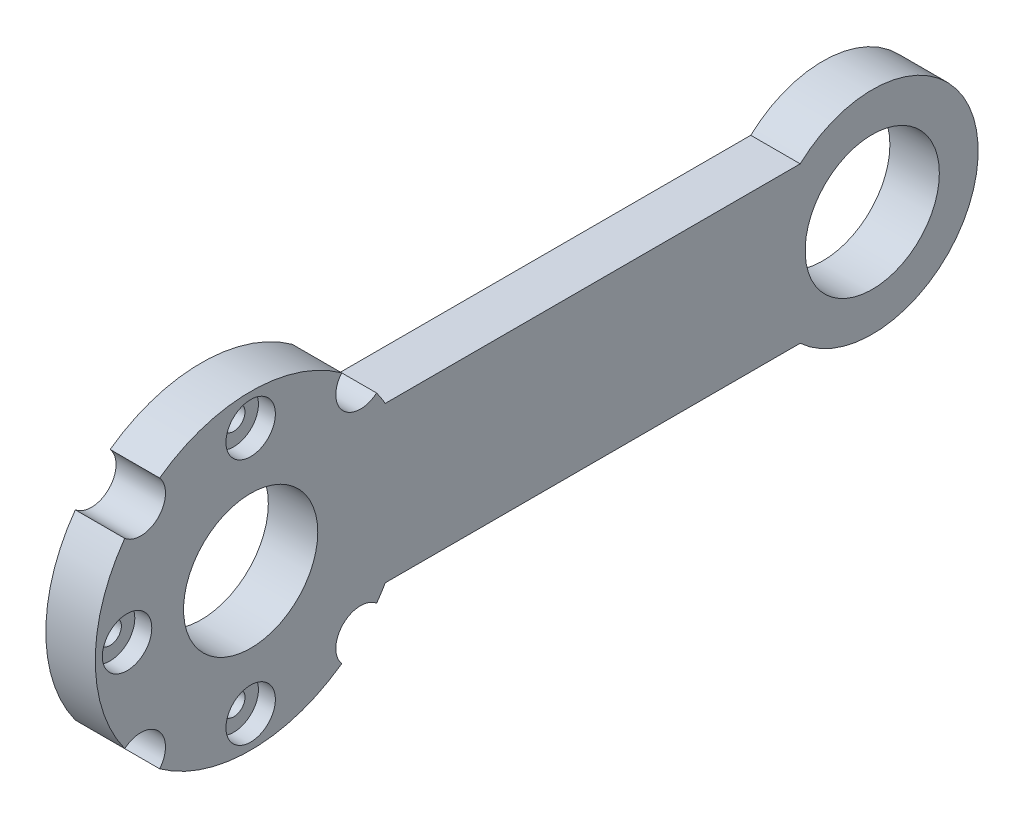
ISO-10303-21;
HEADER;
FILE_DESCRIPTION(('STEP AP214'),'2;1');
FILE_NAME('part.step','',(''),(''),'','','');
FILE_SCHEMA(('AUTOMOTIVE_DESIGN { 1 0 10303 214 1 1 1 1 }'));
ENDSEC;
DATA;
#1=APPLICATION_CONTEXT('core data for automotive mechanical design processes');
#2=APPLICATION_PROTOCOL_DEFINITION('international standard','automotive_design',2000,#1);
#3=PRODUCT_CONTEXT('',#1,'mechanical');
#4=PRODUCT('Part','Part','',(#3));
#5=PRODUCT_RELATED_PRODUCT_CATEGORY('part','',(#4));
#6=PRODUCT_DEFINITION_FORMATION('','',#4);
#7=PRODUCT_DEFINITION_CONTEXT('part definition',#1,'design');
#8=PRODUCT_DEFINITION('design','',#6,#7);
#9=PRODUCT_DEFINITION_SHAPE('','',#8);
#10=(LENGTH_UNIT() NAMED_UNIT(*) SI_UNIT(.MILLI.,.METRE.));
#11=(NAMED_UNIT(*) PLANE_ANGLE_UNIT() SI_UNIT($,.RADIAN.));
#12=(NAMED_UNIT(*) SI_UNIT($,.STERADIAN.) SOLID_ANGLE_UNIT());
#13=UNCERTAINTY_MEASURE_WITH_UNIT(LENGTH_MEASURE(1.E-05),#10,'distance_accuracy_value','');
#14=(GEOMETRIC_REPRESENTATION_CONTEXT(3) GLOBAL_UNCERTAINTY_ASSIGNED_CONTEXT((#13)) GLOBAL_UNIT_ASSIGNED_CONTEXT((#10,
#11,#12)) REPRESENTATION_CONTEXT('',''));
#15=CARTESIAN_POINT('',(0.,0.,0.));
#16=DIRECTION('',(0.,0.,1.));
#17=DIRECTION('',(1.,0.,0.));
#18=AXIS2_PLACEMENT_3D('',#15,#16,#17);
#19=CARTESIAN_POINT('',(7.,0.,0.));
#20=DIRECTION('',(-1.,0.,0.));
#21=DIRECTION('',(0.,0.,1.));
#22=AXIS2_PLACEMENT_3D('',#19,#20,#21);
#23=CYLINDRICAL_SURFACE('',#22,22.);
#24=CARTESIAN_POINT('',(0.,0.,0.));
#25=DIRECTION('',(1.,0.,0.));
#26=DIRECTION('',(0.,0.,-1.));
#27=AXIS2_PLACEMENT_3D('',#24,#25,#26);
#28=CIRCLE('',#27,22.);
#29=CARTESIAN_POINT('',(0.,-17.8265156827671,12.8924527771893));
#30=VERTEX_POINT('',#29);
#31=CARTESIAN_POINT('',(0.,-17.8265156827671,-12.8924527771893));
#32=VERTEX_POINT('',#31);
#33=EDGE_CURVE('E164',#30,#32,#28,.T.);
#34=ORIENTED_EDGE('',*,*,#33,.T.);
#35=DIRECTION('',(1.,0.,0.));
#36=VECTOR('',#35,1.);
#37=CARTESIAN_POINT('',(3.500006,-17.8265156827671,-12.8924527771893));
#38=LINE('',#37,#36);
#39=CARTESIAN_POINT('',(7.,-17.8265156827671,-12.8924527771893));
#40=VERTEX_POINT('',#39);
#41=EDGE_CURVE('E59',#32,#40,#38,.T.);
#42=ORIENTED_EDGE('',*,*,#41,.T.);
#43=CARTESIAN_POINT('',(7.,0.,0.));
#44=DIRECTION('',(1.,0.,0.));
#45=DIRECTION('',(0.,0.,-1.));
#46=AXIS2_PLACEMENT_3D('',#43,#44,#45);
#47=CIRCLE('',#46,22.);
#48=CARTESIAN_POINT('',(7.,-17.8265156827671,12.8924527771893));
#49=VERTEX_POINT('',#48);
#50=EDGE_CURVE('E325',#49,#40,#47,.T.);
#51=ORIENTED_EDGE('',*,*,#50,.F.);
#52=DIRECTION('',(1.,0.,0.));
#53=VECTOR('',#52,1.);
#54=CARTESIAN_POINT('',(3.500006,-17.8265156827671,12.8924527771893));
#55=LINE('',#54,#53);
#56=EDGE_CURVE('E259',#49,#30,#55,.F.);
#57=ORIENTED_EDGE('',*,*,#56,.T.);
#58=EDGE_LOOP('',(#34,#42,#51,#57));
#59=FACE_BOUND('',#58,.T.);
#60=ADVANCED_FACE('F44',(#59),#23,.T.);
#61=CARTESIAN_POINT('',(0.,12.8924527771894,17.8265156827671));
#62=VERTEX_POINT('',#61);
#63=CARTESIAN_POINT('',(0.,-12.8924527771894,17.8265156827671));
#64=VERTEX_POINT('',#63);
#65=EDGE_CURVE('E159',#62,#64,#28,.T.);
#66=ORIENTED_EDGE('',*,*,#65,.T.);
#67=DIRECTION('',(1.,0.,0.));
#68=VECTOR('',#67,1.);
#69=CARTESIAN_POINT('',(3.500006,-12.8924527771894,17.8265156827671));
#70=LINE('',#69,#68);
#71=CARTESIAN_POINT('',(7.,-12.8924527771894,17.8265156827671));
#72=VERTEX_POINT('',#71);
#73=EDGE_CURVE('E67',#64,#72,#70,.T.);
#74=ORIENTED_EDGE('',*,*,#73,.T.);
#75=CARTESIAN_POINT('',(7.,12.8924527771894,17.8265156827671));
#76=VERTEX_POINT('',#75);
#77=EDGE_CURVE('E324',#76,#72,#47,.T.);
#78=ORIENTED_EDGE('',*,*,#77,.F.);
#79=DIRECTION('',(1.,0.,0.));
#80=VECTOR('',#79,1.);
#81=CARTESIAN_POINT('',(3.500006,12.8924527771894,17.8265156827671));
#82=LINE('',#81,#80);
#83=EDGE_CURVE('E266',#76,#62,#82,.F.);
#84=ORIENTED_EDGE('',*,*,#83,.T.);
#85=EDGE_LOOP('',(#66,#74,#78,#84));
#86=FACE_BOUND('',#85,.T.);
#87=ADVANCED_FACE('F296',(#86),#23,.T.);
#88=CARTESIAN_POINT('',(0.,17.8265156827671,-12.8924527771893));
#89=VERTEX_POINT('',#88);
#90=CARTESIAN_POINT('',(0.,17.8265156827672,12.8924527771893));
#91=VERTEX_POINT('',#90);
#92=EDGE_CURVE('E150',#89,#91,#28,.T.);
#93=ORIENTED_EDGE('',*,*,#92,.T.);
#94=DIRECTION('',(1.,0.,0.));
#95=VECTOR('',#94,1.);
#96=CARTESIAN_POINT('',(3.500006,17.8265156827671,12.8924527771893));
#97=LINE('',#96,#95);
#98=CARTESIAN_POINT('',(7.,17.8265156827672,12.8924527771893));
#99=VERTEX_POINT('',#98);
#100=EDGE_CURVE('E264',#91,#99,#97,.T.);
#101=ORIENTED_EDGE('',*,*,#100,.T.);
#102=CARTESIAN_POINT('',(7.,17.8265156827671,-12.8924527771893));
#103=VERTEX_POINT('',#102);
#104=EDGE_CURVE('E152',#103,#99,#47,.T.);
#105=ORIENTED_EDGE('',*,*,#104,.F.);
#106=DIRECTION('',(1.,0.,0.));
#107=VECTOR('',#106,1.);
#108=CARTESIAN_POINT('',(3.500006,17.8265156827671,-12.8924527771893));
#109=LINE('',#108,#107);
#110=EDGE_CURVE('E134',#103,#89,#109,.F.);
#111=ORIENTED_EDGE('',*,*,#110,.T.);
#112=EDGE_LOOP('',(#93,#101,#105,#111));
#113=FACE_BOUND('',#112,.T.);
#114=ADVANCED_FACE('F148',(#113),#23,.T.);
#115=CARTESIAN_POINT('',(0.,11.,-19.0525588832576));
#116=VERTEX_POINT('',#115);
#117=CARTESIAN_POINT('',(0.,12.8924527771894,-17.8265156827671));
#118=VERTEX_POINT('',#117);
#119=EDGE_CURVE('E158',#116,#118,#28,.T.);
#120=ORIENTED_EDGE('',*,*,#119,.T.);
#121=DIRECTION('',(1.,0.,0.));
#122=VECTOR('',#121,1.);
#123=CARTESIAN_POINT('',(3.500006,12.8924527771894,-17.8265156827671));
#124=LINE('',#123,#122);
#125=CARTESIAN_POINT('',(7.,12.8924527771894,-17.8265156827671));
#126=VERTEX_POINT('',#125);
#127=EDGE_CURVE('E137',#118,#126,#124,.T.);
#128=ORIENTED_EDGE('',*,*,#127,.T.);
#129=CARTESIAN_POINT('',(7.,11.,-19.0525588832576));
#130=VERTEX_POINT('',#129);
#131=EDGE_CURVE('E208',#130,#126,#47,.T.);
#132=ORIENTED_EDGE('',*,*,#131,.F.);
#133=DIRECTION('',(-1.,0.,0.));
#134=VECTOR('',#133,1.);
#135=CARTESIAN_POINT('',(7.,11.,-19.0525588832576));
#136=LINE('',#135,#134);
#137=EDGE_CURVE('E177',#130,#116,#136,.T.);
#138=ORIENTED_EDGE('',*,*,#137,.T.);
#139=EDGE_LOOP('',(#120,#128,#132,#138));
#140=FACE_BOUND('',#139,.T.);
#141=ADVANCED_FACE('F305',(#140),#23,.T.);
#142=CARTESIAN_POINT('',(7.,-12.8924527771894,-17.8265156827671));
#143=VERTEX_POINT('',#142);
#144=CARTESIAN_POINT('',(7.,-11.,-19.0525588832576));
#145=VERTEX_POINT('',#144);
#146=EDGE_CURVE('E176',#143,#145,#47,.T.);
#147=ORIENTED_EDGE('',*,*,#146,.F.);
#148=DIRECTION('',(1.,0.,0.));
#149=VECTOR('',#148,1.);
#150=CARTESIAN_POINT('',(3.500006,-12.8924527771894,-17.8265156827671));
#151=LINE('',#150,#149);
#152=CARTESIAN_POINT('',(0.,-12.8924527771894,-17.8265156827671));
#153=VERTEX_POINT('',#152);
#154=EDGE_CURVE('E196',#143,#153,#151,.F.);
#155=ORIENTED_EDGE('',*,*,#154,.T.);
#156=CARTESIAN_POINT('',(0.,-11.,-19.0525588832576));
#157=VERTEX_POINT('',#156);
#158=EDGE_CURVE('E162',#153,#157,#28,.T.);
#159=ORIENTED_EDGE('',*,*,#158,.T.);
#160=DIRECTION('',(-1.,0.,0.));
#161=VECTOR('',#160,1.);
#162=CARTESIAN_POINT('',(7.,-11.,-19.0525588832576));
#163=LINE('',#162,#161);
#164=EDGE_CURVE('E184',#145,#157,#163,.T.);
#165=ORIENTED_EDGE('',*,*,#164,.F.);
#166=EDGE_LOOP('',(#147,#155,#159,#165));
#167=FACE_BOUND('',#166,.T.);
#168=ADVANCED_FACE('F46',(#167),#23,.T.);
#169=CARTESIAN_POINT('',(7.,-11.,0.));
#170=DIRECTION('',(0.,1.,0.));
#171=DIRECTION('',(0.,0.,1.));
#172=AXIS2_PLACEMENT_3D('',#169,#170,#171);
#173=PLANE('',#172);
#174=DIRECTION('',(0.,0.,-1.));
#175=VECTOR('',#174,1.);
#176=CARTESIAN_POINT('',(0.,-11.,0.));
#177=LINE('',#176,#175);
#178=CARTESIAN_POINT('',(0.,-11.,-77.8019609728144));
#179=VERTEX_POINT('',#178);
#180=EDGE_CURVE('E161',#157,#179,#177,.T.);
#181=ORIENTED_EDGE('',*,*,#180,.T.);
#182=DIRECTION('',(-1.,0.,0.));
#183=VECTOR('',#182,1.);
#184=CARTESIAN_POINT('',(7.,-11.,-77.8019609728144));
#185=LINE('',#184,#183);
#186=CARTESIAN_POINT('',(7.,-11.,-77.8019609728144));
#187=VERTEX_POINT('',#186);
#188=EDGE_CURVE('E181',#187,#179,#185,.T.);
#189=ORIENTED_EDGE('',*,*,#188,.F.);
#190=DIRECTION('',(0.,0.,-1.));
#191=VECTOR('',#190,1.);
#192=CARTESIAN_POINT('',(7.,-11.,0.));
#193=LINE('',#192,#191);
#194=EDGE_CURVE('E192',#145,#187,#193,.T.);
#195=ORIENTED_EDGE('',*,*,#194,.F.);
#196=ORIENTED_EDGE('',*,*,#164,.T.);
#197=EDGE_LOOP('',(#181,#189,#195,#196));
#198=FACE_BOUND('',#197,.T.);
#199=ADVANCED_FACE('F189',(#198),#173,.F.);
#200=CARTESIAN_POINT('',(7.,0.,-88.));
#201=DIRECTION('',(-1.,0.,0.));
#202=DIRECTION('',(0.,0.,1.));
#203=AXIS2_PLACEMENT_3D('',#200,#201,#202);
#204=CYLINDRICAL_SURFACE('',#203,15.);
#205=CARTESIAN_POINT('',(0.,0.,-88.));
#206=DIRECTION('',(1.,0.,0.));
#207=DIRECTION('',(0.,0.,-1.));
#208=AXIS2_PLACEMENT_3D('',#205,#206,#207);
#209=CIRCLE('',#208,15.);
#210=CARTESIAN_POINT('',(0.,11.,-77.8019609728144));
#211=VERTEX_POINT('',#210);
#212=EDGE_CURVE('E170',#179,#211,#209,.T.);
#213=ORIENTED_EDGE('',*,*,#212,.T.);
#214=DIRECTION('',(-1.,0.,0.));
#215=VECTOR('',#214,1.);
#216=CARTESIAN_POINT('',(7.,11.,-77.8019609728144));
#217=LINE('',#216,#215);
#218=CARTESIAN_POINT('',(7.,11.,-77.8019609728144));
#219=VERTEX_POINT('',#218);
#220=EDGE_CURVE('E179',#219,#211,#217,.T.);
#221=ORIENTED_EDGE('',*,*,#220,.F.);
#222=CARTESIAN_POINT('',(7.,0.,-88.));
#223=DIRECTION('',(1.,0.,0.));
#224=DIRECTION('',(0.,0.,-1.));
#225=AXIS2_PLACEMENT_3D('',#222,#223,#224);
#226=CIRCLE('',#225,15.);
#227=EDGE_CURVE('E205',#187,#219,#226,.T.);
#228=ORIENTED_EDGE('',*,*,#227,.F.);
#229=ORIENTED_EDGE('',*,*,#188,.T.);
#230=EDGE_LOOP('',(#213,#221,#228,#229));
#231=FACE_BOUND('',#230,.T.);
#232=ADVANCED_FACE('F202',(#231),#204,.T.);
#233=CARTESIAN_POINT('',(7.,11.,0.));
#234=DIRECTION('',(0.,1.,0.));
#235=DIRECTION('',(0.,0.,1.));
#236=AXIS2_PLACEMENT_3D('',#233,#234,#235);
#237=PLANE('',#236);
#238=DIRECTION('',(0.,0.,-1.));
#239=VECTOR('',#238,1.);
#240=CARTESIAN_POINT('',(0.,11.,0.));
#241=LINE('',#240,#239);
#242=EDGE_CURVE('E173',#116,#211,#241,.T.);
#243=ORIENTED_EDGE('',*,*,#242,.F.);
#244=ORIENTED_EDGE('',*,*,#137,.F.);
#245=DIRECTION('',(0.,0.,-1.));
#246=VECTOR('',#245,1.);
#247=CARTESIAN_POINT('',(7.,11.,0.));
#248=LINE('',#247,#246);
#249=EDGE_CURVE('E167',#130,#219,#248,.T.);
#250=ORIENTED_EDGE('',*,*,#249,.T.);
#251=ORIENTED_EDGE('',*,*,#220,.T.);
#252=EDGE_LOOP('',(#243,#244,#250,#251));
#253=FACE_BOUND('',#252,.T.);
#254=ADVANCED_FACE('F317',(#253),#237,.T.);
#255=CARTESIAN_POINT('',(7.,0.,0.));
#256=DIRECTION('',(1.,0.,0.));
#257=DIRECTION('',(0.,0.,-1.));
#258=AXIS2_PLACEMENT_3D('',#255,#256,#257);
#259=PLANE('',#258);
#260=CARTESIAN_POINT('',(7.,0.,-88.));
#261=DIRECTION('',(1.,0.,0.));
#262=DIRECTION('',(0.,0.,-1.));
#263=AXIS2_PLACEMENT_3D('',#260,#261,#262);
#264=CIRCLE('',#263,9.49999999999999);
#265=CARTESIAN_POINT('',(7.,0.,-97.5));
#266=VERTEX_POINT('',#265);
#267=EDGE_CURVE('E274',#266,#266,#264,.T.);
#268=ORIENTED_EDGE('',*,*,#267,.F.);
#269=EDGE_LOOP('',(#268));
#270=FACE_BOUND('',#269,.T.);
#271=CARTESIAN_POINT('',(7.,-15.5563491861041,-15.556349186104));
#272=DIRECTION('',(1.,0.,0.));
#273=DIRECTION('',(0.,0.,-1.));
#274=AXIS2_PLACEMENT_3D('',#271,#272,#273);
#275=CIRCLE('',#274,3.5);
#276=EDGE_CURVE('E256',#143,#40,#275,.T.);
#277=ORIENTED_EDGE('',*,*,#276,.F.);
#278=ORIENTED_EDGE('',*,*,#146,.T.);
#279=ORIENTED_EDGE('',*,*,#194,.T.);
#280=ORIENTED_EDGE('',*,*,#227,.T.);
#281=ORIENTED_EDGE('',*,*,#249,.F.);
#282=ORIENTED_EDGE('',*,*,#131,.T.);
#283=CARTESIAN_POINT('',(7.,15.5563491861041,-15.556349186104));
#284=DIRECTION('',(1.,0.,0.));
#285=DIRECTION('',(0.,0.,-1.));
#286=AXIS2_PLACEMENT_3D('',#283,#284,#285);
#287=CIRCLE('',#286,3.5);
#288=EDGE_CURVE('E142',#103,#126,#287,.T.);
#289=ORIENTED_EDGE('',*,*,#288,.F.);
#290=ORIENTED_EDGE('',*,*,#104,.T.);
#291=CARTESIAN_POINT('',(7.,15.5563491861041,15.556349186104));
#292=DIRECTION('',(1.,0.,0.));
#293=DIRECTION('',(0.,0.,-1.));
#294=AXIS2_PLACEMENT_3D('',#291,#292,#293);
#295=CIRCLE('',#294,3.5);
#296=EDGE_CURVE('E269',#76,#99,#295,.T.);
#297=ORIENTED_EDGE('',*,*,#296,.F.);
#298=ORIENTED_EDGE('',*,*,#77,.T.);
#299=CARTESIAN_POINT('',(7.,-15.5563491861041,15.556349186104));
#300=DIRECTION('',(1.,0.,0.));
#301=DIRECTION('',(0.,0.,-1.));
#302=AXIS2_PLACEMENT_3D('',#299,#300,#301);
#303=CIRCLE('',#302,3.5);
#304=EDGE_CURVE('E262',#49,#72,#303,.T.);
#305=ORIENTED_EDGE('',*,*,#304,.F.);
#306=ORIENTED_EDGE('',*,*,#50,.T.);
#307=EDGE_LOOP('',(#277,#278,#279,#280,#281,#282,#289,#290,#297,#298,#305,#306));
#308=FACE_BOUND('',#307,.T.);
#309=CARTESIAN_POINT('',(7.,0.,0.));
#310=DIRECTION('',(1.,0.,0.));
#311=DIRECTION('',(0.,0.,-1.));
#312=AXIS2_PLACEMENT_3D('',#309,#310,#311);
#313=CIRCLE('',#312,9.5);
#314=CARTESIAN_POINT('',(7.,0.,-9.5));
#315=VERTEX_POINT('',#314);
#316=EDGE_CURVE('E248',#315,#315,#313,.T.);
#317=ORIENTED_EDGE('',*,*,#316,.F.);
#318=EDGE_LOOP('',(#317));
#319=FACE_BOUND('',#318,.T.);
#320=CARTESIAN_POINT('',(7.,17.5,0.));
#321=DIRECTION('',(1.,0.,0.));
#322=DIRECTION('',(0.,0.,-1.));
#323=AXIS2_PLACEMENT_3D('',#320,#321,#322);
#324=CIRCLE('',#323,3.5);
#325=CARTESIAN_POINT('',(7.,17.5,-3.5));
#326=VERTEX_POINT('',#325);
#327=EDGE_CURVE('E245',#326,#326,#324,.T.);
#328=ORIENTED_EDGE('',*,*,#327,.F.);
#329=EDGE_LOOP('',(#328));
#330=FACE_BOUND('',#329,.T.);
#331=CARTESIAN_POINT('',(7.,0.,17.5));
#332=DIRECTION('',(1.,0.,0.));
#333=DIRECTION('',(0.,0.,-1.));
#334=AXIS2_PLACEMENT_3D('',#331,#332,#333);
#335=CIRCLE('',#334,3.5);
#336=CARTESIAN_POINT('',(7.,0.,14.));
#337=VERTEX_POINT('',#336);
#338=EDGE_CURVE('E233',#337,#337,#335,.T.);
#339=ORIENTED_EDGE('',*,*,#338,.F.);
#340=EDGE_LOOP('',(#339));
#341=FACE_BOUND('',#340,.T.);
#342=CARTESIAN_POINT('',(7.,-17.5,0.));
#343=DIRECTION('',(1.,0.,0.));
#344=DIRECTION('',(0.,0.,-1.));
#345=AXIS2_PLACEMENT_3D('',#342,#343,#344);
#346=CIRCLE('',#345,3.5);
#347=CARTESIAN_POINT('',(7.,-17.5,-3.5));
#348=VERTEX_POINT('',#347);
#349=EDGE_CURVE('E221',#348,#348,#346,.T.);
#350=ORIENTED_EDGE('',*,*,#349,.F.);
#351=EDGE_LOOP('',(#350));
#352=FACE_BOUND('',#351,.T.);
#353=ADVANCED_FACE('F319',(#270,#308,#319,#330,#341,#352),#259,.T.);
#354=CARTESIAN_POINT('',(0.,0.,0.));
#355=DIRECTION('',(1.,0.,0.));
#356=DIRECTION('',(0.,0.,-1.));
#357=AXIS2_PLACEMENT_3D('',#354,#355,#356);
#358=PLANE('',#357);
#359=CARTESIAN_POINT('',(0.,0.,-88.));
#360=DIRECTION('',(1.,0.,0.));
#361=DIRECTION('',(0.,0.,-1.));
#362=AXIS2_PLACEMENT_3D('',#359,#360,#361);
#363=CIRCLE('',#362,9.49999999999999);
#364=CARTESIAN_POINT('',(0.,0.,-97.5));
#365=VERTEX_POINT('',#364);
#366=EDGE_CURVE('E277',#365,#365,#363,.T.);
#367=ORIENTED_EDGE('',*,*,#366,.T.);
#368=EDGE_LOOP('',(#367));
#369=FACE_BOUND('',#368,.T.);
#370=CARTESIAN_POINT('',(0.,0.,0.));
#371=DIRECTION('',(1.,0.,0.));
#372=DIRECTION('',(0.,0.,-1.));
#373=AXIS2_PLACEMENT_3D('',#370,#371,#372);
#374=CIRCLE('',#373,9.5);
#375=CARTESIAN_POINT('',(0.,0.,-9.5));
#376=VERTEX_POINT('',#375);
#377=EDGE_CURVE('E251',#376,#376,#374,.T.);
#378=ORIENTED_EDGE('',*,*,#377,.T.);
#379=EDGE_LOOP('',(#378));
#380=FACE_BOUND('',#379,.T.);
#381=CARTESIAN_POINT('',(0.,17.5,0.));
#382=DIRECTION('',(1.,0.,0.));
#383=DIRECTION('',(0.,0.,-1.));
#384=AXIS2_PLACEMENT_3D('',#381,#382,#383);
#385=CIRCLE('',#384,1.6);
#386=CARTESIAN_POINT('',(0.,17.5,-1.6));
#387=VERTEX_POINT('',#386);
#388=EDGE_CURVE('E236',#387,#387,#385,.T.);
#389=ORIENTED_EDGE('',*,*,#388,.T.);
#390=EDGE_LOOP('',(#389));
#391=FACE_BOUND('',#390,.T.);
#392=CARTESIAN_POINT('',(0.,0.,17.5));
#393=DIRECTION('',(1.,0.,0.));
#394=DIRECTION('',(0.,0.,-1.));
#395=AXIS2_PLACEMENT_3D('',#392,#393,#394);
#396=CIRCLE('',#395,1.6);
#397=CARTESIAN_POINT('',(0.,0.,15.9));
#398=VERTEX_POINT('',#397);
#399=EDGE_CURVE('E224',#398,#398,#396,.T.);
#400=ORIENTED_EDGE('',*,*,#399,.T.);
#401=EDGE_LOOP('',(#400));
#402=FACE_BOUND('',#401,.T.);
#403=CARTESIAN_POINT('',(0.,-17.5,0.));
#404=DIRECTION('',(1.,0.,0.));
#405=DIRECTION('',(0.,0.,-1.));
#406=AXIS2_PLACEMENT_3D('',#403,#404,#405);
#407=CIRCLE('',#406,1.6);
#408=CARTESIAN_POINT('',(0.,-17.5,-1.6));
#409=VERTEX_POINT('',#408);
#410=EDGE_CURVE('E197',#409,#409,#407,.T.);
#411=ORIENTED_EDGE('',*,*,#410,.T.);
#412=EDGE_LOOP('',(#411));
#413=FACE_BOUND('',#412,.T.);
#414=ORIENTED_EDGE('',*,*,#158,.F.);
#415=CARTESIAN_POINT('',(0.,-15.5563491861041,-15.556349186104));
#416=DIRECTION('',(1.,0.,0.));
#417=DIRECTION('',(0.,0.,-1.));
#418=AXIS2_PLACEMENT_3D('',#415,#416,#417);
#419=CIRCLE('',#418,3.5);
#420=EDGE_CURVE('E143',#153,#32,#419,.T.);
#421=ORIENTED_EDGE('',*,*,#420,.T.);
#422=ORIENTED_EDGE('',*,*,#33,.F.);
#423=CARTESIAN_POINT('',(0.,-15.5563491861041,15.556349186104));
#424=DIRECTION('',(1.,0.,0.));
#425=DIRECTION('',(0.,0.,-1.));
#426=AXIS2_PLACEMENT_3D('',#423,#424,#425);
#427=CIRCLE('',#426,3.5);
#428=EDGE_CURVE('E11',#30,#64,#427,.T.);
#429=ORIENTED_EDGE('',*,*,#428,.T.);
#430=ORIENTED_EDGE('',*,*,#65,.F.);
#431=CARTESIAN_POINT('',(0.,15.5563491861041,15.556349186104));
#432=DIRECTION('',(1.,0.,0.));
#433=DIRECTION('',(0.,0.,-1.));
#434=AXIS2_PLACEMENT_3D('',#431,#432,#433);
#435=CIRCLE('',#434,3.5);
#436=EDGE_CURVE('E52',#62,#91,#435,.T.);
#437=ORIENTED_EDGE('',*,*,#436,.T.);
#438=ORIENTED_EDGE('',*,*,#92,.F.);
#439=CARTESIAN_POINT('',(0.,15.5563491861041,-15.556349186104));
#440=DIRECTION('',(1.,0.,0.));
#441=DIRECTION('',(0.,0.,-1.));
#442=AXIS2_PLACEMENT_3D('',#439,#440,#441);
#443=CIRCLE('',#442,3.5);
#444=EDGE_CURVE('E131',#89,#118,#443,.T.);
#445=ORIENTED_EDGE('',*,*,#444,.T.);
#446=ORIENTED_EDGE('',*,*,#119,.F.);
#447=ORIENTED_EDGE('',*,*,#242,.T.);
#448=ORIENTED_EDGE('',*,*,#212,.F.);
#449=ORIENTED_EDGE('',*,*,#180,.F.);
#450=EDGE_LOOP('',(#414,#421,#422,#429,#430,#437,#438,#445,#446,#447,#448,#449));
#451=FACE_BOUND('',#450,.T.);
#452=ADVANCED_FACE('F156',(#369,#380,#391,#402,#413,#451),#358,.F.);
#453=CARTESIAN_POINT('',(7.,-17.5,0.));
#454=DIRECTION('',(1.,0.,0.));
#455=DIRECTION('',(0.,0.,-1.));
#456=AXIS2_PLACEMENT_3D('',#453,#454,#455);
#457=CYLINDRICAL_SURFACE('',#456,1.6);
#458=ORIENTED_EDGE('',*,*,#410,.F.);
#459=EDGE_LOOP('',(#458));
#460=FACE_BOUND('',#459,.T.);
#461=CARTESIAN_POINT('',(4.6,-17.5,0.));
#462=DIRECTION('',(1.,0.,0.));
#463=DIRECTION('',(0.,0.,-1.));
#464=AXIS2_PLACEMENT_3D('',#461,#462,#463);
#465=CIRCLE('',#464,1.6);
#466=CARTESIAN_POINT('',(4.6,-17.5,-1.6));
#467=VERTEX_POINT('',#466);
#468=EDGE_CURVE('E215',#467,#467,#465,.T.);
#469=ORIENTED_EDGE('',*,*,#468,.T.);
#470=EDGE_LOOP('',(#469));
#471=FACE_BOUND('',#470,.T.);
#472=ADVANCED_FACE('F373',(#460,#471),#457,.F.);
#473=CARTESIAN_POINT('',(4.6,-15.9,0.));
#474=DIRECTION('',(-1.,0.,0.));
#475=DIRECTION('',(0.,0.,1.));
#476=AXIS2_PLACEMENT_3D('',#473,#474,#475);
#477=PLANE('',#476);
#478=ORIENTED_EDGE('',*,*,#468,.F.);
#479=EDGE_LOOP('',(#478));
#480=FACE_BOUND('',#479,.T.);
#481=CARTESIAN_POINT('',(4.6,-17.5,0.));
#482=DIRECTION('',(1.,0.,0.));
#483=DIRECTION('',(0.,0.,-1.));
#484=AXIS2_PLACEMENT_3D('',#481,#482,#483);
#485=CIRCLE('',#484,3.5);
#486=CARTESIAN_POINT('',(4.6,-17.5,-3.5));
#487=VERTEX_POINT('',#486);
#488=EDGE_CURVE('E218',#487,#487,#485,.T.);
#489=ORIENTED_EDGE('',*,*,#488,.T.);
#490=EDGE_LOOP('',(#489));
#491=FACE_BOUND('',#490,.T.);
#492=ADVANCED_FACE('F369',(#480,#491),#477,.F.);
#493=CARTESIAN_POINT('',(7.,-17.5,0.));
#494=DIRECTION('',(1.,0.,0.));
#495=DIRECTION('',(0.,0.,-1.));
#496=AXIS2_PLACEMENT_3D('',#493,#494,#495);
#497=CYLINDRICAL_SURFACE('',#496,3.5);
#498=ORIENTED_EDGE('',*,*,#488,.F.);
#499=EDGE_LOOP('',(#498));
#500=FACE_BOUND('',#499,.T.);
#501=ORIENTED_EDGE('',*,*,#349,.T.);
#502=EDGE_LOOP('',(#501));
#503=FACE_BOUND('',#502,.T.);
#504=ADVANCED_FACE('F365',(#500,#503),#497,.F.);
#505=CARTESIAN_POINT('',(7.,0.,17.5));
#506=DIRECTION('',(1.,0.,0.));
#507=DIRECTION('',(0.,0.,-1.));
#508=AXIS2_PLACEMENT_3D('',#505,#506,#507);
#509=CYLINDRICAL_SURFACE('',#508,1.6);
#510=ORIENTED_EDGE('',*,*,#399,.F.);
#511=EDGE_LOOP('',(#510));
#512=FACE_BOUND('',#511,.T.);
#513=CARTESIAN_POINT('',(4.6,0.,17.5));
#514=DIRECTION('',(1.,0.,0.));
#515=DIRECTION('',(0.,0.,-1.));
#516=AXIS2_PLACEMENT_3D('',#513,#514,#515);
#517=CIRCLE('',#516,1.6);
#518=CARTESIAN_POINT('',(4.6,0.,15.9));
#519=VERTEX_POINT('',#518);
#520=EDGE_CURVE('E227',#519,#519,#517,.T.);
#521=ORIENTED_EDGE('',*,*,#520,.T.);
#522=EDGE_LOOP('',(#521));
#523=FACE_BOUND('',#522,.T.);
#524=ADVANCED_FACE('F361',(#512,#523),#509,.F.);
#525=CARTESIAN_POINT('',(4.6,1.6,17.5));
#526=DIRECTION('',(-1.,0.,0.));
#527=DIRECTION('',(0.,0.,1.));
#528=AXIS2_PLACEMENT_3D('',#525,#526,#527);
#529=PLANE('',#528);
#530=ORIENTED_EDGE('',*,*,#520,.F.);
#531=EDGE_LOOP('',(#530));
#532=FACE_BOUND('',#531,.T.);
#533=CARTESIAN_POINT('',(4.6,0.,17.5));
#534=DIRECTION('',(1.,0.,0.));
#535=DIRECTION('',(0.,0.,-1.));
#536=AXIS2_PLACEMENT_3D('',#533,#534,#535);
#537=CIRCLE('',#536,3.5);
#538=CARTESIAN_POINT('',(4.6,0.,14.));
#539=VERTEX_POINT('',#538);
#540=EDGE_CURVE('E230',#539,#539,#537,.T.);
#541=ORIENTED_EDGE('',*,*,#540,.T.);
#542=EDGE_LOOP('',(#541));
#543=FACE_BOUND('',#542,.T.);
#544=ADVANCED_FACE('F357',(#532,#543),#529,.F.);
#545=CARTESIAN_POINT('',(7.,0.,17.5));
#546=DIRECTION('',(1.,0.,0.));
#547=DIRECTION('',(0.,0.,-1.));
#548=AXIS2_PLACEMENT_3D('',#545,#546,#547);
#549=CYLINDRICAL_SURFACE('',#548,3.5);
#550=ORIENTED_EDGE('',*,*,#540,.F.);
#551=EDGE_LOOP('',(#550));
#552=FACE_BOUND('',#551,.T.);
#553=ORIENTED_EDGE('',*,*,#338,.T.);
#554=EDGE_LOOP('',(#553));
#555=FACE_BOUND('',#554,.T.);
#556=ADVANCED_FACE('F353',(#552,#555),#549,.F.);
#557=CARTESIAN_POINT('',(7.,17.5,0.));
#558=DIRECTION('',(1.,0.,0.));
#559=DIRECTION('',(0.,0.,-1.));
#560=AXIS2_PLACEMENT_3D('',#557,#558,#559);
#561=CYLINDRICAL_SURFACE('',#560,1.6);
#562=ORIENTED_EDGE('',*,*,#388,.F.);
#563=EDGE_LOOP('',(#562));
#564=FACE_BOUND('',#563,.T.);
#565=CARTESIAN_POINT('',(4.6,17.5,0.));
#566=DIRECTION('',(1.,0.,0.));
#567=DIRECTION('',(0.,0.,-1.));
#568=AXIS2_PLACEMENT_3D('',#565,#566,#567);
#569=CIRCLE('',#568,1.6);
#570=CARTESIAN_POINT('',(4.6,17.5,-1.6));
#571=VERTEX_POINT('',#570);
#572=EDGE_CURVE('E239',#571,#571,#569,.T.);
#573=ORIENTED_EDGE('',*,*,#572,.T.);
#574=EDGE_LOOP('',(#573));
#575=FACE_BOUND('',#574,.T.);
#576=ADVANCED_FACE('F349',(#564,#575),#561,.F.);
#577=CARTESIAN_POINT('',(4.6,19.1,0.));
#578=DIRECTION('',(-1.,0.,0.));
#579=DIRECTION('',(0.,0.,1.));
#580=AXIS2_PLACEMENT_3D('',#577,#578,#579);
#581=PLANE('',#580);
#582=ORIENTED_EDGE('',*,*,#572,.F.);
#583=EDGE_LOOP('',(#582));
#584=FACE_BOUND('',#583,.T.);
#585=CARTESIAN_POINT('',(4.6,17.5,0.));
#586=DIRECTION('',(1.,0.,0.));
#587=DIRECTION('',(0.,0.,-1.));
#588=AXIS2_PLACEMENT_3D('',#585,#586,#587);
#589=CIRCLE('',#588,3.5);
#590=CARTESIAN_POINT('',(4.6,17.5,-3.5));
#591=VERTEX_POINT('',#590);
#592=EDGE_CURVE('E242',#591,#591,#589,.T.);
#593=ORIENTED_EDGE('',*,*,#592,.T.);
#594=EDGE_LOOP('',(#593));
#595=FACE_BOUND('',#594,.T.);
#596=ADVANCED_FACE('F345',(#584,#595),#581,.F.);
#597=CARTESIAN_POINT('',(7.,17.5,0.));
#598=DIRECTION('',(1.,0.,0.));
#599=DIRECTION('',(0.,0.,-1.));
#600=AXIS2_PLACEMENT_3D('',#597,#598,#599);
#601=CYLINDRICAL_SURFACE('',#600,3.5);
#602=ORIENTED_EDGE('',*,*,#592,.F.);
#603=EDGE_LOOP('',(#602));
#604=FACE_BOUND('',#603,.T.);
#605=ORIENTED_EDGE('',*,*,#327,.T.);
#606=EDGE_LOOP('',(#605));
#607=FACE_BOUND('',#606,.T.);
#608=ADVANCED_FACE('F341',(#604,#607),#601,.F.);
#609=CARTESIAN_POINT('',(0.,0.,0.));
#610=DIRECTION('',(1.,0.,0.));
#611=DIRECTION('',(0.,0.,-1.));
#612=AXIS2_PLACEMENT_3D('',#609,#610,#611);
#613=CYLINDRICAL_SURFACE('',#612,9.5);
#614=ORIENTED_EDGE('',*,*,#316,.T.);
#615=EDGE_LOOP('',(#614));
#616=FACE_BOUND('',#615,.T.);
#617=ORIENTED_EDGE('',*,*,#377,.F.);
#618=EDGE_LOOP('',(#617));
#619=FACE_BOUND('',#618,.T.);
#620=ADVANCED_FACE('F337',(#616,#619),#613,.F.);
#621=CARTESIAN_POINT('',(0.,15.5563491861041,-15.556349186104));
#622=DIRECTION('',(1.,0.,0.));
#623=DIRECTION('',(0.,0.,-1.));
#624=AXIS2_PLACEMENT_3D('',#621,#622,#623);
#625=CYLINDRICAL_SURFACE('',#624,3.5);
#626=ORIENTED_EDGE('',*,*,#444,.F.);
#627=ORIENTED_EDGE('',*,*,#110,.F.);
#628=ORIENTED_EDGE('',*,*,#288,.T.);
#629=ORIENTED_EDGE('',*,*,#127,.F.);
#630=EDGE_LOOP('',(#626,#627,#628,#629));
#631=FACE_BOUND('',#630,.T.);
#632=ADVANCED_FACE('F133',(#631),#625,.F.);
#633=CARTESIAN_POINT('',(0.,15.5563491861041,15.556349186104));
#634=DIRECTION('',(1.,0.,0.));
#635=DIRECTION('',(0.,0.,-1.));
#636=AXIS2_PLACEMENT_3D('',#633,#634,#635);
#637=CYLINDRICAL_SURFACE('',#636,3.5);
#638=ORIENTED_EDGE('',*,*,#436,.F.);
#639=ORIENTED_EDGE('',*,*,#83,.F.);
#640=ORIENTED_EDGE('',*,*,#296,.T.);
#641=ORIENTED_EDGE('',*,*,#100,.F.);
#642=EDGE_LOOP('',(#638,#639,#640,#641));
#643=FACE_BOUND('',#642,.T.);
#644=ADVANCED_FACE('F331',(#643),#637,.F.);
#645=CARTESIAN_POINT('',(0.,-15.5563491861041,15.556349186104));
#646=DIRECTION('',(1.,0.,0.));
#647=DIRECTION('',(0.,0.,-1.));
#648=AXIS2_PLACEMENT_3D('',#645,#646,#647);
#649=CYLINDRICAL_SURFACE('',#648,3.5);
#650=ORIENTED_EDGE('',*,*,#428,.F.);
#651=ORIENTED_EDGE('',*,*,#56,.F.);
#652=ORIENTED_EDGE('',*,*,#304,.T.);
#653=ORIENTED_EDGE('',*,*,#73,.F.);
#654=EDGE_LOOP('',(#650,#651,#652,#653));
#655=FACE_BOUND('',#654,.T.);
#656=ADVANCED_FACE('F292',(#655),#649,.F.);
#657=CARTESIAN_POINT('',(0.,-15.5563491861041,-15.556349186104));
#658=DIRECTION('',(1.,0.,0.));
#659=DIRECTION('',(0.,0.,-1.));
#660=AXIS2_PLACEMENT_3D('',#657,#658,#659);
#661=CYLINDRICAL_SURFACE('',#660,3.5);
#662=ORIENTED_EDGE('',*,*,#420,.F.);
#663=ORIENTED_EDGE('',*,*,#154,.F.);
#664=ORIENTED_EDGE('',*,*,#276,.T.);
#665=ORIENTED_EDGE('',*,*,#41,.F.);
#666=EDGE_LOOP('',(#662,#663,#664,#665));
#667=FACE_BOUND('',#666,.T.);
#668=ADVANCED_FACE('F285',(#667),#661,.F.);
#669=CARTESIAN_POINT('',(0.,0.,-88.));
#670=DIRECTION('',(1.,0.,0.));
#671=DIRECTION('',(0.,0.,-1.));
#672=AXIS2_PLACEMENT_3D('',#669,#670,#671);
#673=CYLINDRICAL_SURFACE('',#672,9.49999999999999);
#674=ORIENTED_EDGE('',*,*,#267,.T.);
#675=EDGE_LOOP('',(#674));
#676=FACE_BOUND('',#675,.T.);
#677=ORIENTED_EDGE('',*,*,#366,.F.);
#678=EDGE_LOOP('',(#677));
#679=FACE_BOUND('',#678,.T.);
#680=ADVANCED_FACE('F283',(#676,#679),#673,.F.);
#681=CLOSED_SHELL('',(#60,#87,#114,#141,#168,#199,#232,#254,#353,#452,#472,#492,#504,#524,#544,
#556,#576,#596,#608,#620,#632,#644,#656,#668,#680));
#682=MANIFOLD_SOLID_BREP('B2',#681);
#683=ADVANCED_BREP_SHAPE_REPRESENTATION('',(#18,#682),#14);
#684=SHAPE_DEFINITION_REPRESENTATION(#9,#683);
ENDSEC;
END-ISO-10303-21;
